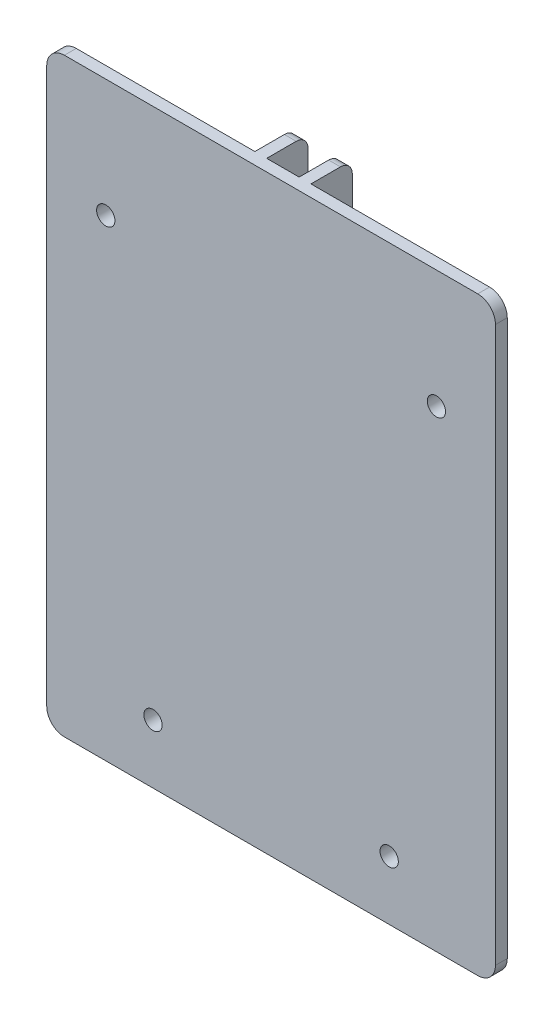
ISO-10303-21;
HEADER;
FILE_DESCRIPTION(('STEP AP214'),'2;1');
FILE_NAME('part.step','',(''),(''),'','','');
FILE_SCHEMA(('AUTOMOTIVE_DESIGN { 1 0 10303 214 1 1 1 1 }'));
ENDSEC;
DATA;
#1=APPLICATION_CONTEXT('core data for automotive mechanical design processes');
#2=APPLICATION_PROTOCOL_DEFINITION('international standard','automotive_design',2000,#1);
#3=PRODUCT_CONTEXT('',#1,'mechanical');
#4=PRODUCT('Part','Part','',(#3));
#5=PRODUCT_RELATED_PRODUCT_CATEGORY('part','',(#4));
#6=PRODUCT_DEFINITION_FORMATION('','',#4);
#7=PRODUCT_DEFINITION_CONTEXT('part definition',#1,'design');
#8=PRODUCT_DEFINITION('design','',#6,#7);
#9=PRODUCT_DEFINITION_SHAPE('','',#8);
#10=(LENGTH_UNIT() NAMED_UNIT(*) SI_UNIT(.MILLI.,.METRE.));
#11=(NAMED_UNIT(*) PLANE_ANGLE_UNIT() SI_UNIT($,.RADIAN.));
#12=(NAMED_UNIT(*) SI_UNIT($,.STERADIAN.) SOLID_ANGLE_UNIT());
#13=UNCERTAINTY_MEASURE_WITH_UNIT(LENGTH_MEASURE(1.E-05),#10,'distance_accuracy_value','');
#14=(GEOMETRIC_REPRESENTATION_CONTEXT(3) GLOBAL_UNCERTAINTY_ASSIGNED_CONTEXT((#13)) GLOBAL_UNIT_ASSIGNED_CONTEXT((#10,
#11,#12)) REPRESENTATION_CONTEXT('',''));
#15=CARTESIAN_POINT('',(0.,0.,0.));
#16=DIRECTION('',(0.,0.,1.));
#17=DIRECTION('',(1.,0.,0.));
#18=AXIS2_PLACEMENT_3D('',#15,#16,#17);
#19=CARTESIAN_POINT('',(0.,0.,9.));
#20=DIRECTION('',(1.,0.,0.));
#21=DIRECTION('',(0.,0.,-1.));
#22=AXIS2_PLACEMENT_3D('',#19,#20,#21);
#23=PLANE('',#22);
#24=DIRECTION('',(0.,1.,0.));
#25=VECTOR('',#24,1.);
#26=CARTESIAN_POINT('',(0.,100.,7.));
#27=LINE('',#26,#25);
#28=CARTESIAN_POINT('',(0.,3.,7.));
#29=VERTEX_POINT('',#28);
#30=CARTESIAN_POINT('',(0.,97.,7.));
#31=VERTEX_POINT('',#30);
#32=EDGE_CURVE('E203',#29,#31,#27,.T.);
#33=ORIENTED_EDGE('',*,*,#32,.F.);
#34=DIRECTION('',(0.,0.,-1.));
#35=VECTOR('',#34,1.);
#36=CARTESIAN_POINT('',(0.,3.,9.));
#37=LINE('',#36,#35);
#38=CARTESIAN_POINT('',(0.,3.,9.));
#39=VERTEX_POINT('',#38);
#40=EDGE_CURVE('E294',#29,#39,#37,.F.);
#41=ORIENTED_EDGE('',*,*,#40,.T.);
#42=DIRECTION('',(0.,-1.,0.));
#43=VECTOR('',#42,1.);
#44=CARTESIAN_POINT('',(0.,0.,9.));
#45=LINE('',#44,#43);
#46=CARTESIAN_POINT('',(0.,97.,9.));
#47=VERTEX_POINT('',#46);
#48=EDGE_CURVE('E212',#47,#39,#45,.T.);
#49=ORIENTED_EDGE('',*,*,#48,.F.);
#50=DIRECTION('',(0.,0.,-1.));
#51=VECTOR('',#50,1.);
#52=CARTESIAN_POINT('',(0.,97.,9.));
#53=LINE('',#52,#51);
#54=EDGE_CURVE('E291',#47,#31,#53,.T.);
#55=ORIENTED_EDGE('',*,*,#54,.T.);
#56=EDGE_LOOP('',(#33,#41,#49,#55));
#57=FACE_BOUND('',#56,.T.);
#58=ADVANCED_FACE('F33',(#57),#23,.F.);
#59=CARTESIAN_POINT('',(76.,0.,9.));
#60=DIRECTION('',(-1.,0.,0.));
#61=DIRECTION('',(0.,0.,1.));
#62=AXIS2_PLACEMENT_3D('',#59,#60,#61);
#63=PLANE('',#62);
#64=DIRECTION('',(0.,1.,0.));
#65=VECTOR('',#64,1.);
#66=CARTESIAN_POINT('',(76.,0.,9.));
#67=LINE('',#66,#65);
#68=CARTESIAN_POINT('',(76.,3.,9.));
#69=VERTEX_POINT('',#68);
#70=CARTESIAN_POINT('',(76.,97.,9.));
#71=VERTEX_POINT('',#70);
#72=EDGE_CURVE('E268',#69,#71,#67,.T.);
#73=ORIENTED_EDGE('',*,*,#72,.F.);
#74=DIRECTION('',(0.,0.,-1.));
#75=VECTOR('',#74,1.);
#76=CARTESIAN_POINT('',(76.,3.,9.));
#77=LINE('',#76,#75);
#78=CARTESIAN_POINT('',(76.,3.,7.));
#79=VERTEX_POINT('',#78);
#80=EDGE_CURVE('E306',#69,#79,#77,.T.);
#81=ORIENTED_EDGE('',*,*,#80,.T.);
#82=DIRECTION('',(0.,-1.,0.));
#83=VECTOR('',#82,1.);
#84=CARTESIAN_POINT('',(76.,100.,7.));
#85=LINE('',#84,#83);
#86=CARTESIAN_POINT('',(76.,97.,7.));
#87=VERTEX_POINT('',#86);
#88=EDGE_CURVE('E214',#87,#79,#85,.T.);
#89=ORIENTED_EDGE('',*,*,#88,.F.);
#90=DIRECTION('',(0.,0.,-1.));
#91=VECTOR('',#90,1.);
#92=CARTESIAN_POINT('',(76.,97.,9.));
#93=LINE('',#92,#91);
#94=EDGE_CURVE('E304',#87,#71,#93,.F.);
#95=ORIENTED_EDGE('',*,*,#94,.T.);
#96=EDGE_LOOP('',(#73,#81,#89,#95));
#97=FACE_BOUND('',#96,.T.);
#98=ADVANCED_FACE('F422',(#97),#63,.F.);
#99=CARTESIAN_POINT('',(0.,0.,0.));
#100=DIRECTION('',(0.,0.,-1.));
#101=DIRECTION('',(-1.,0.,0.));
#102=AXIS2_PLACEMENT_3D('',#99,#100,#101);
#103=PLANE('',#102);
#104=DIRECTION('',(0.,1.,0.));
#105=VECTOR('',#104,1.);
#106=CARTESIAN_POINT('',(35.25,100.,0.));
#107=LINE('',#106,#105);
#108=CARTESIAN_POINT('',(35.25,2.,0.));
#109=VERTEX_POINT('',#108);
#110=CARTESIAN_POINT('',(35.25,98.,0.));
#111=VERTEX_POINT('',#110);
#112=EDGE_CURVE('E248',#109,#111,#107,.T.);
#113=ORIENTED_EDGE('',*,*,#112,.F.);
#114=DIRECTION('',(1.,0.,0.));
#115=VECTOR('',#114,1.);
#116=CARTESIAN_POINT('',(33.25,2.,0.));
#117=LINE('',#116,#115);
#118=CARTESIAN_POINT('',(33.25,2.,0.));
#119=VERTEX_POINT('',#118);
#120=EDGE_CURVE('E329',#109,#119,#117,.F.);
#121=ORIENTED_EDGE('',*,*,#120,.T.);
#122=DIRECTION('',(0.,-1.,0.));
#123=VECTOR('',#122,1.);
#124=CARTESIAN_POINT('',(33.25,100.,0.));
#125=LINE('',#124,#123);
#126=CARTESIAN_POINT('',(33.25,98.,0.));
#127=VERTEX_POINT('',#126);
#128=EDGE_CURVE('E196',#127,#119,#125,.T.);
#129=ORIENTED_EDGE('',*,*,#128,.F.);
#130=DIRECTION('',(-1.,0.,0.));
#131=VECTOR('',#130,1.);
#132=CARTESIAN_POINT('',(35.25,98.,0.));
#133=LINE('',#132,#131);
#134=EDGE_CURVE('E327',#127,#111,#133,.F.);
#135=ORIENTED_EDGE('',*,*,#134,.T.);
#136=EDGE_LOOP('',(#113,#121,#129,#135));
#137=FACE_BOUND('',#136,.T.);
#138=ADVANCED_FACE('F428',(#137),#103,.T.);
#139=CARTESIAN_POINT('',(0.,0.,9.));
#140=DIRECTION('',(0.,1.,0.));
#141=DIRECTION('',(0.,0.,1.));
#142=AXIS2_PLACEMENT_3D('',#139,#140,#141);
#143=PLANE('',#142);
#144=DIRECTION('',(0.,0.,-1.));
#145=VECTOR('',#144,1.);
#146=CARTESIAN_POINT('',(33.25,0.,7.));
#147=LINE('',#146,#145);
#148=CARTESIAN_POINT('',(33.25,0.,7.));
#149=VERTEX_POINT('',#148);
#150=CARTESIAN_POINT('',(33.25,0.,2.));
#151=VERTEX_POINT('',#150);
#152=EDGE_CURVE('E175',#149,#151,#147,.T.);
#153=ORIENTED_EDGE('',*,*,#152,.T.);
#154=DIRECTION('',(1.,0.,0.));
#155=VECTOR('',#154,1.);
#156=CARTESIAN_POINT('',(35.25,0.,2.));
#157=LINE('',#156,#155);
#158=CARTESIAN_POINT('',(35.25,0.,2.));
#159=VERTEX_POINT('',#158);
#160=EDGE_CURVE('E321',#151,#159,#157,.T.);
#161=ORIENTED_EDGE('',*,*,#160,.T.);
#162=DIRECTION('',(0.,0.,-1.));
#163=VECTOR('',#162,1.);
#164=CARTESIAN_POINT('',(35.25,0.,7.));
#165=LINE('',#164,#163);
#166=CARTESIAN_POINT('',(35.25,0.,7.));
#167=VERTEX_POINT('',#166);
#168=EDGE_CURVE('E229',#167,#159,#165,.T.);
#169=ORIENTED_EDGE('',*,*,#168,.F.);
#170=DIRECTION('',(-1.,0.,0.));
#171=VECTOR('',#170,1.);
#172=CARTESIAN_POINT('',(35.25,0.,7.));
#173=LINE('',#172,#171);
#174=CARTESIAN_POINT('',(40.75,0.,7.));
#175=VERTEX_POINT('',#174);
#176=EDGE_CURVE('E244',#175,#167,#173,.T.);
#177=ORIENTED_EDGE('',*,*,#176,.F.);
#178=DIRECTION('',(0.,0.,-1.));
#179=VECTOR('',#178,1.);
#180=CARTESIAN_POINT('',(40.75,0.,7.));
#181=LINE('',#180,#179);
#182=CARTESIAN_POINT('',(40.75,0.,2.));
#183=VERTEX_POINT('',#182);
#184=EDGE_CURVE('E255',#175,#183,#181,.T.);
#185=ORIENTED_EDGE('',*,*,#184,.T.);
#186=DIRECTION('',(1.,0.,0.));
#187=VECTOR('',#186,1.);
#188=CARTESIAN_POINT('',(42.75,0.,2.));
#189=LINE('',#188,#187);
#190=CARTESIAN_POINT('',(42.75,0.,2.));
#191=VERTEX_POINT('',#190);
#192=EDGE_CURVE('E318',#183,#191,#189,.T.);
#193=ORIENTED_EDGE('',*,*,#192,.T.);
#194=DIRECTION('',(0.,0.,-1.));
#195=VECTOR('',#194,1.);
#196=CARTESIAN_POINT('',(42.75,0.,7.));
#197=LINE('',#196,#195);
#198=CARTESIAN_POINT('',(42.75,0.,7.));
#199=VERTEX_POINT('',#198);
#200=EDGE_CURVE('E226',#199,#191,#197,.T.);
#201=ORIENTED_EDGE('',*,*,#200,.F.);
#202=DIRECTION('',(-1.,0.,0.));
#203=VECTOR('',#202,1.);
#204=CARTESIAN_POINT('',(76.,0.,7.));
#205=LINE('',#204,#203);
#206=CARTESIAN_POINT('',(73.,0.,7.));
#207=VERTEX_POINT('',#206);
#208=EDGE_CURVE('E217',#207,#199,#205,.T.);
#209=ORIENTED_EDGE('',*,*,#208,.F.);
#210=DIRECTION('',(0.,0.,-1.));
#211=VECTOR('',#210,1.);
#212=CARTESIAN_POINT('',(73.,0.,9.));
#213=LINE('',#212,#211);
#214=CARTESIAN_POINT('',(73.,0.,9.));
#215=VERTEX_POINT('',#214);
#216=EDGE_CURVE('E274',#207,#215,#213,.F.);
#217=ORIENTED_EDGE('',*,*,#216,.T.);
#218=DIRECTION('',(1.,0.,0.));
#219=VECTOR('',#218,1.);
#220=CARTESIAN_POINT('',(0.,0.,9.));
#221=LINE('',#220,#219);
#222=CARTESIAN_POINT('',(3.,0.,9.));
#223=VERTEX_POINT('',#222);
#224=EDGE_CURVE('E265',#223,#215,#221,.T.);
#225=ORIENTED_EDGE('',*,*,#224,.F.);
#226=DIRECTION('',(0.,0.,-1.));
#227=VECTOR('',#226,1.);
#228=CARTESIAN_POINT('',(3.,0.,9.));
#229=LINE('',#228,#227);
#230=CARTESIAN_POINT('',(3.,0.,7.));
#231=VERTEX_POINT('',#230);
#232=EDGE_CURVE('E202',#223,#231,#229,.T.);
#233=ORIENTED_EDGE('',*,*,#232,.T.);
#234=DIRECTION('',(-1.,0.,0.));
#235=VECTOR('',#234,1.);
#236=CARTESIAN_POINT('',(33.25,0.,7.));
#237=LINE('',#236,#235);
#238=EDGE_CURVE('E194',#149,#231,#237,.T.);
#239=ORIENTED_EDGE('',*,*,#238,.F.);
#240=EDGE_LOOP('',(#153,#161,#169,#177,#185,#193,#201,#209,#217,#225,#233,#239));
#241=FACE_BOUND('',#240,.T.);
#242=ADVANCED_FACE('F199',(#241),#143,.F.);
#243=CARTESIAN_POINT('',(0.,100.,9.));
#244=DIRECTION('',(0.,-1.,0.));
#245=DIRECTION('',(0.,0.,-1.));
#246=AXIS2_PLACEMENT_3D('',#243,#244,#245);
#247=PLANE('',#246);
#248=DIRECTION('',(0.,0.,-1.));
#249=VECTOR('',#248,1.);
#250=CARTESIAN_POINT('',(35.25,100.,7.));
#251=LINE('',#250,#249);
#252=CARTESIAN_POINT('',(35.25,100.,7.));
#253=VERTEX_POINT('',#252);
#254=CARTESIAN_POINT('',(35.25,100.,2.));
#255=VERTEX_POINT('',#254);
#256=EDGE_CURVE('E247',#253,#255,#251,.T.);
#257=ORIENTED_EDGE('',*,*,#256,.T.);
#258=DIRECTION('',(-1.,0.,0.));
#259=VECTOR('',#258,1.);
#260=CARTESIAN_POINT('',(33.25,100.,2.));
#261=LINE('',#260,#259);
#262=CARTESIAN_POINT('',(33.25,100.,2.));
#263=VERTEX_POINT('',#262);
#264=EDGE_CURVE('E11',#255,#263,#261,.T.);
#265=ORIENTED_EDGE('',*,*,#264,.T.);
#266=DIRECTION('',(0.,0.,-1.));
#267=VECTOR('',#266,1.);
#268=CARTESIAN_POINT('',(33.25,100.,7.));
#269=LINE('',#268,#267);
#270=CARTESIAN_POINT('',(33.25,100.,7.));
#271=VERTEX_POINT('',#270);
#272=EDGE_CURVE('E188',#271,#263,#269,.T.);
#273=ORIENTED_EDGE('',*,*,#272,.F.);
#274=DIRECTION('',(1.,0.,0.));
#275=VECTOR('',#274,1.);
#276=CARTESIAN_POINT('',(33.25,100.,7.));
#277=LINE('',#276,#275);
#278=CARTESIAN_POINT('',(3.,100.,7.));
#279=VERTEX_POINT('',#278);
#280=EDGE_CURVE('E189',#279,#271,#277,.T.);
#281=ORIENTED_EDGE('',*,*,#280,.F.);
#282=DIRECTION('',(0.,0.,-1.));
#283=VECTOR('',#282,1.);
#284=CARTESIAN_POINT('',(3.,100.,9.));
#285=LINE('',#284,#283);
#286=CARTESIAN_POINT('',(3.,100.,9.));
#287=VERTEX_POINT('',#286);
#288=EDGE_CURVE('E316',#279,#287,#285,.F.);
#289=ORIENTED_EDGE('',*,*,#288,.T.);
#290=DIRECTION('',(-1.,0.,0.));
#291=VECTOR('',#290,1.);
#292=CARTESIAN_POINT('',(0.,100.,9.));
#293=LINE('',#292,#291);
#294=CARTESIAN_POINT('',(73.,100.,9.));
#295=VERTEX_POINT('',#294);
#296=EDGE_CURVE('E271',#295,#287,#293,.T.);
#297=ORIENTED_EDGE('',*,*,#296,.F.);
#298=DIRECTION('',(0.,0.,-1.));
#299=VECTOR('',#298,1.);
#300=CARTESIAN_POINT('',(73.,100.,9.));
#301=LINE('',#300,#299);
#302=CARTESIAN_POINT('',(73.,100.,7.));
#303=VERTEX_POINT('',#302);
#304=EDGE_CURVE('E313',#295,#303,#301,.T.);
#305=ORIENTED_EDGE('',*,*,#304,.T.);
#306=DIRECTION('',(1.,0.,0.));
#307=VECTOR('',#306,1.);
#308=CARTESIAN_POINT('',(76.,100.,7.));
#309=LINE('',#308,#307);
#310=CARTESIAN_POINT('',(42.75,100.,7.));
#311=VERTEX_POINT('',#310);
#312=EDGE_CURVE('E223',#311,#303,#309,.T.);
#313=ORIENTED_EDGE('',*,*,#312,.F.);
#314=DIRECTION('',(0.,0.,-1.));
#315=VECTOR('',#314,1.);
#316=CARTESIAN_POINT('',(42.75,100.,7.));
#317=LINE('',#316,#315);
#318=CARTESIAN_POINT('',(42.75,100.,2.));
#319=VERTEX_POINT('',#318);
#320=EDGE_CURVE('E211',#311,#319,#317,.T.);
#321=ORIENTED_EDGE('',*,*,#320,.T.);
#322=DIRECTION('',(-1.,0.,0.));
#323=VECTOR('',#322,1.);
#324=CARTESIAN_POINT('',(40.75,100.,2.));
#325=LINE('',#324,#323);
#326=CARTESIAN_POINT('',(40.75,100.,2.));
#327=VERTEX_POINT('',#326);
#328=EDGE_CURVE('E42',#319,#327,#325,.T.);
#329=ORIENTED_EDGE('',*,*,#328,.T.);
#330=DIRECTION('',(0.,0.,-1.));
#331=VECTOR('',#330,1.);
#332=CARTESIAN_POINT('',(40.75,100.,7.));
#333=LINE('',#332,#331);
#334=CARTESIAN_POINT('',(40.75,100.,7.));
#335=VERTEX_POINT('',#334);
#336=EDGE_CURVE('E258',#335,#327,#333,.T.);
#337=ORIENTED_EDGE('',*,*,#336,.F.);
#338=DIRECTION('',(1.,0.,0.));
#339=VECTOR('',#338,1.);
#340=CARTESIAN_POINT('',(35.25,100.,7.));
#341=LINE('',#340,#339);
#342=EDGE_CURVE('E237',#253,#335,#341,.T.);
#343=ORIENTED_EDGE('',*,*,#342,.F.);
#344=EDGE_LOOP('',(#257,#265,#273,#281,#289,#297,#305,#313,#321,#329,#337,#343));
#345=FACE_BOUND('',#344,.T.);
#346=ADVANCED_FACE('F470',(#345),#247,.F.);
#347=CARTESIAN_POINT('',(0.,0.,9.));
#348=DIRECTION('',(0.,0.,-1.));
#349=DIRECTION('',(-1.,0.,0.));
#350=AXIS2_PLACEMENT_3D('',#347,#348,#349);
#351=PLANE('',#350);
#352=CARTESIAN_POINT('',(66.,80.,9.));
#353=DIRECTION('',(0.,0.,-1.));
#354=DIRECTION('',(-1.,0.,0.));
#355=AXIS2_PLACEMENT_3D('',#352,#353,#354);
#356=CIRCLE('',#355,1.54999999999999);
#357=CARTESIAN_POINT('',(64.45,80.,9.));
#358=VERTEX_POINT('',#357);
#359=EDGE_CURVE('E349',#358,#358,#356,.T.);
#360=ORIENTED_EDGE('',*,*,#359,.T.);
#361=EDGE_LOOP('',(#360));
#362=FACE_BOUND('',#361,.T.);
#363=CARTESIAN_POINT('',(58.,10.,9.));
#364=DIRECTION('',(0.,0.,-1.));
#365=DIRECTION('',(-1.,0.,0.));
#366=AXIS2_PLACEMENT_3D('',#363,#364,#365);
#367=CIRCLE('',#366,1.55);
#368=CARTESIAN_POINT('',(56.45,10.,9.));
#369=VERTEX_POINT('',#368);
#370=EDGE_CURVE('E743',#369,#369,#367,.T.);
#371=ORIENTED_EDGE('',*,*,#370,.T.);
#372=EDGE_LOOP('',(#371));
#373=FACE_BOUND('',#372,.T.);
#374=CARTESIAN_POINT('',(18.,10.,9.));
#375=DIRECTION('',(0.,0.,-1.));
#376=DIRECTION('',(-1.,0.,0.));
#377=AXIS2_PLACEMENT_3D('',#374,#375,#376);
#378=CIRCLE('',#377,1.55);
#379=CARTESIAN_POINT('',(16.45,10.,9.));
#380=VERTEX_POINT('',#379);
#381=EDGE_CURVE('E746',#380,#380,#378,.T.);
#382=ORIENTED_EDGE('',*,*,#381,.T.);
#383=EDGE_LOOP('',(#382));
#384=FACE_BOUND('',#383,.T.);
#385=CARTESIAN_POINT('',(10.,80.,9.));
#386=DIRECTION('',(0.,0.,-1.));
#387=DIRECTION('',(-1.,0.,0.));
#388=AXIS2_PLACEMENT_3D('',#385,#386,#387);
#389=CIRCLE('',#388,1.54999999999999);
#390=CARTESIAN_POINT('',(8.45000000000001,80.,9.));
#391=VERTEX_POINT('',#390);
#392=EDGE_CURVE('E750',#391,#391,#389,.T.);
#393=ORIENTED_EDGE('',*,*,#392,.T.);
#394=EDGE_LOOP('',(#393));
#395=FACE_BOUND('',#394,.T.);
#396=ORIENTED_EDGE('',*,*,#48,.T.);
#397=CARTESIAN_POINT('',(3.,3.,9.));
#398=DIRECTION('',(0.,0.,-1.));
#399=DIRECTION('',(-1.,0.,0.));
#400=AXIS2_PLACEMENT_3D('',#397,#398,#399);
#401=CIRCLE('',#400,3.);
#402=EDGE_CURVE('E302',#39,#223,#401,.F.);
#403=ORIENTED_EDGE('',*,*,#402,.T.);
#404=ORIENTED_EDGE('',*,*,#224,.T.);
#405=CARTESIAN_POINT('',(73.,3.,9.));
#406=DIRECTION('',(0.,0.,-1.));
#407=DIRECTION('',(-1.,0.,0.));
#408=AXIS2_PLACEMENT_3D('',#405,#406,#407);
#409=CIRCLE('',#408,3.);
#410=EDGE_CURVE('E300',#215,#69,#409,.F.);
#411=ORIENTED_EDGE('',*,*,#410,.T.);
#412=ORIENTED_EDGE('',*,*,#72,.T.);
#413=CARTESIAN_POINT('',(73.,97.,9.));
#414=DIRECTION('',(0.,0.,-1.));
#415=DIRECTION('',(-1.,0.,0.));
#416=AXIS2_PLACEMENT_3D('',#413,#414,#415);
#417=CIRCLE('',#416,3.);
#418=EDGE_CURVE('E296',#71,#295,#417,.F.);
#419=ORIENTED_EDGE('',*,*,#418,.T.);
#420=ORIENTED_EDGE('',*,*,#296,.T.);
#421=CARTESIAN_POINT('',(3.,97.,9.));
#422=DIRECTION('',(0.,0.,-1.));
#423=DIRECTION('',(-1.,0.,0.));
#424=AXIS2_PLACEMENT_3D('',#421,#422,#423);
#425=CIRCLE('',#424,3.);
#426=EDGE_CURVE('E298',#287,#47,#425,.F.);
#427=ORIENTED_EDGE('',*,*,#426,.T.);
#428=EDGE_LOOP('',(#396,#403,#404,#411,#412,#419,#420,#427));
#429=FACE_BOUND('',#428,.T.);
#430=ADVANCED_FACE('F485',(#362,#373,#384,#395,#429),#351,.F.);
#431=DIRECTION('',(0.,1.,0.));
#432=VECTOR('',#431,1.);
#433=CARTESIAN_POINT('',(42.75,100.,0.));
#434=LINE('',#433,#432);
#435=CARTESIAN_POINT('',(42.75,2.,0.));
#436=VERTEX_POINT('',#435);
#437=CARTESIAN_POINT('',(42.75,98.,0.));
#438=VERTEX_POINT('',#437);
#439=EDGE_CURVE('E218',#436,#438,#434,.T.);
#440=ORIENTED_EDGE('',*,*,#439,.F.);
#441=DIRECTION('',(1.,0.,0.));
#442=VECTOR('',#441,1.);
#443=CARTESIAN_POINT('',(40.75,2.,0.));
#444=LINE('',#443,#442);
#445=CARTESIAN_POINT('',(40.75,2.,0.));
#446=VERTEX_POINT('',#445);
#447=EDGE_CURVE('E58',#436,#446,#444,.F.);
#448=ORIENTED_EDGE('',*,*,#447,.T.);
#449=DIRECTION('',(0.,-1.,0.));
#450=VECTOR('',#449,1.);
#451=CARTESIAN_POINT('',(40.75,100.,0.));
#452=LINE('',#451,#450);
#453=CARTESIAN_POINT('',(40.75,98.,0.));
#454=VERTEX_POINT('',#453);
#455=EDGE_CURVE('E238',#454,#446,#452,.T.);
#456=ORIENTED_EDGE('',*,*,#455,.F.);
#457=DIRECTION('',(-1.,0.,0.));
#458=VECTOR('',#457,1.);
#459=CARTESIAN_POINT('',(42.75,98.,0.));
#460=LINE('',#459,#458);
#461=EDGE_CURVE('E338',#454,#438,#460,.F.);
#462=ORIENTED_EDGE('',*,*,#461,.T.);
#463=EDGE_LOOP('',(#440,#448,#456,#462));
#464=FACE_BOUND('',#463,.T.);
#465=ADVANCED_FACE('F507',(#464),#103,.T.);
#466=CARTESIAN_POINT('',(35.25,100.,7.));
#467=DIRECTION('',(-1.,0.,0.));
#468=DIRECTION('',(0.,-1.,0.));
#469=AXIS2_PLACEMENT_3D('',#466,#467,#468);
#470=PLANE('',#469);
#471=CARTESIAN_POINT('',(35.25,20.,3.5));
#472=DIRECTION('',(-1.,0.,0.));
#473=DIRECTION('',(0.,-1.,0.));
#474=AXIS2_PLACEMENT_3D('',#471,#472,#473);
#475=CIRCLE('',#474,1.55);
#476=CARTESIAN_POINT('',(35.25,18.45,3.5));
#477=VERTEX_POINT('',#476);
#478=EDGE_CURVE('E251',#477,#477,#475,.T.);
#479=ORIENTED_EDGE('',*,*,#478,.T.);
#480=EDGE_LOOP('',(#479));
#481=FACE_BOUND('',#480,.T.);
#482=CARTESIAN_POINT('',(35.25,90.,3.5));
#483=DIRECTION('',(-1.,0.,0.));
#484=DIRECTION('',(0.,-1.,0.));
#485=AXIS2_PLACEMENT_3D('',#482,#483,#484);
#486=CIRCLE('',#485,1.55);
#487=CARTESIAN_POINT('',(35.25,88.45,3.5));
#488=VERTEX_POINT('',#487);
#489=EDGE_CURVE('E284',#488,#488,#486,.T.);
#490=ORIENTED_EDGE('',*,*,#489,.T.);
#491=EDGE_LOOP('',(#490));
#492=FACE_BOUND('',#491,.T.);
#493=ORIENTED_EDGE('',*,*,#168,.T.);
#494=CARTESIAN_POINT('',(35.25,2.,2.));
#495=DIRECTION('',(-1.,0.,0.));
#496=DIRECTION('',(0.,-1.,0.));
#497=AXIS2_PLACEMENT_3D('',#494,#495,#496);
#498=CIRCLE('',#497,2.);
#499=EDGE_CURVE('E325',#159,#109,#498,.F.);
#500=ORIENTED_EDGE('',*,*,#499,.T.);
#501=ORIENTED_EDGE('',*,*,#112,.T.);
#502=CARTESIAN_POINT('',(35.25,98.,2.));
#503=DIRECTION('',(-1.,0.,0.));
#504=DIRECTION('',(0.,-1.,0.));
#505=AXIS2_PLACEMENT_3D('',#502,#503,#504);
#506=CIRCLE('',#505,2.);
#507=EDGE_CURVE('E323',#111,#255,#506,.F.);
#508=ORIENTED_EDGE('',*,*,#507,.T.);
#509=ORIENTED_EDGE('',*,*,#256,.F.);
#510=DIRECTION('',(0.,1.,0.));
#511=VECTOR('',#510,1.);
#512=CARTESIAN_POINT('',(35.25,100.,7.));
#513=LINE('',#512,#511);
#514=EDGE_CURVE('E234',#167,#253,#513,.T.);
#515=ORIENTED_EDGE('',*,*,#514,.F.);
#516=EDGE_LOOP('',(#493,#500,#501,#508,#509,#515));
#517=FACE_BOUND('',#516,.T.);
#518=ADVANCED_FACE('F399',(#481,#492,#517),#470,.F.);
#519=CARTESIAN_POINT('',(40.75,100.,7.));
#520=DIRECTION('',(1.,0.,0.));
#521=DIRECTION('',(0.,1.,0.));
#522=AXIS2_PLACEMENT_3D('',#519,#520,#521);
#523=PLANE('',#522);
#524=CARTESIAN_POINT('',(40.75,20.,3.5));
#525=DIRECTION('',(1.,0.,0.));
#526=DIRECTION('',(0.,1.,0.));
#527=AXIS2_PLACEMENT_3D('',#524,#525,#526);
#528=CIRCLE('',#527,1.55);
#529=CARTESIAN_POINT('',(40.75,21.55,3.5));
#530=VERTEX_POINT('',#529);
#531=EDGE_CURVE('E283',#530,#530,#528,.T.);
#532=ORIENTED_EDGE('',*,*,#531,.T.);
#533=EDGE_LOOP('',(#532));
#534=FACE_BOUND('',#533,.T.);
#535=CARTESIAN_POINT('',(40.75,90.,3.5));
#536=DIRECTION('',(1.,0.,0.));
#537=DIRECTION('',(0.,1.,0.));
#538=AXIS2_PLACEMENT_3D('',#535,#536,#537);
#539=CIRCLE('',#538,1.55);
#540=CARTESIAN_POINT('',(40.75,91.55,3.5));
#541=VERTEX_POINT('',#540);
#542=EDGE_CURVE('E278',#541,#541,#539,.T.);
#543=ORIENTED_EDGE('',*,*,#542,.T.);
#544=EDGE_LOOP('',(#543));
#545=FACE_BOUND('',#544,.T.);
#546=ORIENTED_EDGE('',*,*,#455,.T.);
#547=CARTESIAN_POINT('',(40.75,2.,2.));
#548=DIRECTION('',(1.,0.,0.));
#549=DIRECTION('',(0.,1.,0.));
#550=AXIS2_PLACEMENT_3D('',#547,#548,#549);
#551=CIRCLE('',#550,2.);
#552=EDGE_CURVE('E342',#446,#183,#551,.F.);
#553=ORIENTED_EDGE('',*,*,#552,.T.);
#554=ORIENTED_EDGE('',*,*,#184,.F.);
#555=DIRECTION('',(0.,-1.,0.));
#556=VECTOR('',#555,1.);
#557=CARTESIAN_POINT('',(40.75,100.,7.));
#558=LINE('',#557,#556);
#559=EDGE_CURVE('E241',#335,#175,#558,.T.);
#560=ORIENTED_EDGE('',*,*,#559,.F.);
#561=ORIENTED_EDGE('',*,*,#336,.T.);
#562=CARTESIAN_POINT('',(40.75,98.,2.));
#563=DIRECTION('',(1.,0.,0.));
#564=DIRECTION('',(0.,1.,0.));
#565=AXIS2_PLACEMENT_3D('',#562,#563,#564);
#566=CIRCLE('',#565,2.);
#567=EDGE_CURVE('E50',#327,#454,#566,.F.);
#568=ORIENTED_EDGE('',*,*,#567,.T.);
#569=EDGE_LOOP('',(#546,#553,#554,#560,#561,#568));
#570=FACE_BOUND('',#569,.T.);
#571=ADVANCED_FACE('F509',(#534,#545,#570),#523,.F.);
#572=CARTESIAN_POINT('',(0.,0.,7.));
#573=DIRECTION('',(0.,0.,1.));
#574=DIRECTION('',(1.,0.,0.));
#575=AXIS2_PLACEMENT_3D('',#572,#573,#574);
#576=PLANE('',#575);
#577=ORIENTED_EDGE('',*,*,#514,.T.);
#578=ORIENTED_EDGE('',*,*,#342,.T.);
#579=ORIENTED_EDGE('',*,*,#559,.T.);
#580=ORIENTED_EDGE('',*,*,#176,.T.);
#581=EDGE_LOOP('',(#577,#578,#579,#580));
#582=FACE_BOUND('',#581,.T.);
#583=ADVANCED_FACE('F473',(#582),#576,.F.);
#584=CARTESIAN_POINT('',(42.75,100.,7.));
#585=DIRECTION('',(-1.,0.,0.));
#586=DIRECTION('',(0.,-1.,0.));
#587=AXIS2_PLACEMENT_3D('',#584,#585,#586);
#588=PLANE('',#587);
#589=CARTESIAN_POINT('',(42.75,20.,3.5));
#590=DIRECTION('',(1.,0.,0.));
#591=DIRECTION('',(0.,1.,0.));
#592=AXIS2_PLACEMENT_3D('',#589,#590,#591);
#593=CIRCLE('',#592,1.55);
#594=CARTESIAN_POINT('',(42.75,21.55,3.5));
#595=VERTEX_POINT('',#594);
#596=EDGE_CURVE('E279',#595,#595,#593,.T.);
#597=ORIENTED_EDGE('',*,*,#596,.F.);
#598=EDGE_LOOP('',(#597));
#599=FACE_BOUND('',#598,.T.);
#600=CARTESIAN_POINT('',(42.75,90.,3.5));
#601=DIRECTION('',(1.,0.,0.));
#602=DIRECTION('',(0.,1.,0.));
#603=AXIS2_PLACEMENT_3D('',#600,#601,#602);
#604=CIRCLE('',#603,1.55);
#605=CARTESIAN_POINT('',(42.75,91.55,3.5));
#606=VERTEX_POINT('',#605);
#607=EDGE_CURVE('E384',#606,#606,#604,.T.);
#608=ORIENTED_EDGE('',*,*,#607,.F.);
#609=EDGE_LOOP('',(#608));
#610=FACE_BOUND('',#609,.T.);
#611=ORIENTED_EDGE('',*,*,#200,.T.);
#612=CARTESIAN_POINT('',(42.75,2.,2.));
#613=DIRECTION('',(-1.,0.,0.));
#614=DIRECTION('',(0.,-1.,0.));
#615=AXIS2_PLACEMENT_3D('',#612,#613,#614);
#616=CIRCLE('',#615,2.);
#617=EDGE_CURVE('E336',#191,#436,#616,.F.);
#618=ORIENTED_EDGE('',*,*,#617,.T.);
#619=ORIENTED_EDGE('',*,*,#439,.T.);
#620=CARTESIAN_POINT('',(42.75,98.,2.));
#621=DIRECTION('',(-1.,0.,0.));
#622=DIRECTION('',(0.,-1.,0.));
#623=AXIS2_PLACEMENT_3D('',#620,#621,#622);
#624=CIRCLE('',#623,2.);
#625=EDGE_CURVE('E334',#438,#319,#624,.F.);
#626=ORIENTED_EDGE('',*,*,#625,.T.);
#627=ORIENTED_EDGE('',*,*,#320,.F.);
#628=DIRECTION('',(0.,1.,0.));
#629=VECTOR('',#628,1.);
#630=CARTESIAN_POINT('',(42.75,100.,7.));
#631=LINE('',#630,#629);
#632=EDGE_CURVE('E220',#199,#311,#631,.T.);
#633=ORIENTED_EDGE('',*,*,#632,.F.);
#634=EDGE_LOOP('',(#611,#618,#619,#626,#627,#633));
#635=FACE_BOUND('',#634,.T.);
#636=ADVANCED_FACE('F503',(#599,#610,#635),#588,.F.);
#637=CARTESIAN_POINT('',(0.,0.,7.));
#638=DIRECTION('',(0.,0.,-1.));
#639=DIRECTION('',(-1.,0.,0.));
#640=AXIS2_PLACEMENT_3D('',#637,#638,#639);
#641=PLANE('',#640);
#642=CARTESIAN_POINT('',(58.,10.,7.));
#643=DIRECTION('',(0.,0.,-1.));
#644=DIRECTION('',(-1.,0.,0.));
#645=AXIS2_PLACEMENT_3D('',#642,#643,#644);
#646=CIRCLE('',#645,3.);
#647=CARTESIAN_POINT('',(55.,10.,7.));
#648=VERTEX_POINT('',#647);
#649=EDGE_CURVE('E356',#648,#648,#646,.T.);
#650=ORIENTED_EDGE('',*,*,#649,.F.);
#651=EDGE_LOOP('',(#650));
#652=FACE_BOUND('',#651,.T.);
#653=CARTESIAN_POINT('',(66.,80.,7.));
#654=DIRECTION('',(0.,0.,-1.));
#655=DIRECTION('',(-1.,0.,0.));
#656=AXIS2_PLACEMENT_3D('',#653,#654,#655);
#657=CIRCLE('',#656,3.00000000000001);
#658=CARTESIAN_POINT('',(63.,80.,7.));
#659=VERTEX_POINT('',#658);
#660=EDGE_CURVE('E378',#659,#659,#657,.T.);
#661=ORIENTED_EDGE('',*,*,#660,.F.);
#662=EDGE_LOOP('',(#661));
#663=FACE_BOUND('',#662,.T.);
#664=ORIENTED_EDGE('',*,*,#88,.T.);
#665=CARTESIAN_POINT('',(73.,3.,7.));
#666=DIRECTION('',(0.,0.,-1.));
#667=DIRECTION('',(-1.,0.,0.));
#668=AXIS2_PLACEMENT_3D('',#665,#666,#667);
#669=CIRCLE('',#668,3.);
#670=EDGE_CURVE('E311',#79,#207,#669,.T.);
#671=ORIENTED_EDGE('',*,*,#670,.T.);
#672=ORIENTED_EDGE('',*,*,#208,.T.);
#673=ORIENTED_EDGE('',*,*,#632,.T.);
#674=ORIENTED_EDGE('',*,*,#312,.T.);
#675=CARTESIAN_POINT('',(73.,97.,7.));
#676=DIRECTION('',(0.,0.,-1.));
#677=DIRECTION('',(-1.,0.,0.));
#678=AXIS2_PLACEMENT_3D('',#675,#676,#677);
#679=CIRCLE('',#678,3.);
#680=EDGE_CURVE('E309',#303,#87,#679,.T.);
#681=ORIENTED_EDGE('',*,*,#680,.T.);
#682=EDGE_LOOP('',(#664,#671,#672,#673,#674,#681));
#683=FACE_BOUND('',#682,.T.);
#684=ADVANCED_FACE('F500',(#652,#663,#683),#641,.T.);
#685=CARTESIAN_POINT('',(33.25,100.,7.));
#686=DIRECTION('',(1.,0.,0.));
#687=DIRECTION('',(0.,1.,0.));
#688=AXIS2_PLACEMENT_3D('',#685,#686,#687);
#689=PLANE('',#688);
#690=CARTESIAN_POINT('',(33.25,20.,3.5));
#691=DIRECTION('',(1.,0.,0.));
#692=DIRECTION('',(0.,1.,0.));
#693=AXIS2_PLACEMENT_3D('',#690,#691,#692);
#694=CIRCLE('',#693,1.55);
#695=CARTESIAN_POINT('',(33.25,21.55,3.5));
#696=VERTEX_POINT('',#695);
#697=EDGE_CURVE('E280',#696,#696,#694,.T.);
#698=ORIENTED_EDGE('',*,*,#697,.T.);
#699=EDGE_LOOP('',(#698));
#700=FACE_BOUND('',#699,.T.);
#701=CARTESIAN_POINT('',(33.25,90.,3.5));
#702=DIRECTION('',(1.,0.,0.));
#703=DIRECTION('',(0.,1.,0.));
#704=AXIS2_PLACEMENT_3D('',#701,#702,#703);
#705=CIRCLE('',#704,1.55);
#706=CARTESIAN_POINT('',(33.25,91.55,3.5));
#707=VERTEX_POINT('',#706);
#708=EDGE_CURVE('E275',#707,#707,#705,.T.);
#709=ORIENTED_EDGE('',*,*,#708,.T.);
#710=EDGE_LOOP('',(#709));
#711=FACE_BOUND('',#710,.T.);
#712=ORIENTED_EDGE('',*,*,#128,.T.);
#713=CARTESIAN_POINT('',(33.25,2.,2.));
#714=DIRECTION('',(1.,0.,0.));
#715=DIRECTION('',(0.,1.,0.));
#716=AXIS2_PLACEMENT_3D('',#713,#714,#715);
#717=CIRCLE('',#716,2.);
#718=EDGE_CURVE('E183',#119,#151,#717,.F.);
#719=ORIENTED_EDGE('',*,*,#718,.T.);
#720=ORIENTED_EDGE('',*,*,#152,.F.);
#721=DIRECTION('',(0.,-1.,0.));
#722=VECTOR('',#721,1.);
#723=CARTESIAN_POINT('',(33.25,100.,7.));
#724=LINE('',#723,#722);
#725=EDGE_CURVE('E180',#271,#149,#724,.T.);
#726=ORIENTED_EDGE('',*,*,#725,.F.);
#727=ORIENTED_EDGE('',*,*,#272,.T.);
#728=CARTESIAN_POINT('',(33.25,98.,2.));
#729=DIRECTION('',(1.,0.,0.));
#730=DIRECTION('',(0.,1.,0.));
#731=AXIS2_PLACEMENT_3D('',#728,#729,#730);
#732=CIRCLE('',#731,2.);
#733=EDGE_CURVE('E331',#263,#127,#732,.F.);
#734=ORIENTED_EDGE('',*,*,#733,.T.);
#735=EDGE_LOOP('',(#712,#719,#720,#726,#727,#734));
#736=FACE_BOUND('',#735,.T.);
#737=ADVANCED_FACE('F178',(#700,#711,#736),#689,.F.);
#738=CARTESIAN_POINT('',(0.,0.,7.));
#739=DIRECTION('',(0.,0.,-1.));
#740=DIRECTION('',(-1.,0.,0.));
#741=AXIS2_PLACEMENT_3D('',#738,#739,#740);
#742=PLANE('',#741);
#743=CARTESIAN_POINT('',(18.,10.,7.));
#744=DIRECTION('',(0.,0.,-1.));
#745=DIRECTION('',(-1.,0.,0.));
#746=AXIS2_PLACEMENT_3D('',#743,#744,#745);
#747=CIRCLE('',#746,3.);
#748=CARTESIAN_POINT('',(15.,10.,7.));
#749=VERTEX_POINT('',#748);
#750=EDGE_CURVE('E365',#749,#749,#747,.T.);
#751=ORIENTED_EDGE('',*,*,#750,.F.);
#752=EDGE_LOOP('',(#751));
#753=FACE_BOUND('',#752,.T.);
#754=CARTESIAN_POINT('',(10.,80.,7.));
#755=DIRECTION('',(0.,0.,-1.));
#756=DIRECTION('',(-1.,0.,0.));
#757=AXIS2_PLACEMENT_3D('',#754,#755,#756);
#758=CIRCLE('',#757,3.);
#759=CARTESIAN_POINT('',(7.,80.,7.));
#760=VERTEX_POINT('',#759);
#761=EDGE_CURVE('E372',#760,#760,#758,.T.);
#762=ORIENTED_EDGE('',*,*,#761,.F.);
#763=EDGE_LOOP('',(#762));
#764=FACE_BOUND('',#763,.T.);
#765=ORIENTED_EDGE('',*,*,#238,.T.);
#766=CARTESIAN_POINT('',(3.,3.,7.));
#767=DIRECTION('',(0.,0.,-1.));
#768=DIRECTION('',(-1.,0.,0.));
#769=AXIS2_PLACEMENT_3D('',#766,#767,#768);
#770=CIRCLE('',#769,3.);
#771=EDGE_CURVE('E289',#231,#29,#770,.T.);
#772=ORIENTED_EDGE('',*,*,#771,.T.);
#773=ORIENTED_EDGE('',*,*,#32,.T.);
#774=CARTESIAN_POINT('',(3.,97.,7.));
#775=DIRECTION('',(0.,0.,-1.));
#776=DIRECTION('',(-1.,0.,0.));
#777=AXIS2_PLACEMENT_3D('',#774,#775,#776);
#778=CIRCLE('',#777,3.);
#779=EDGE_CURVE('E287',#31,#279,#778,.T.);
#780=ORIENTED_EDGE('',*,*,#779,.T.);
#781=ORIENTED_EDGE('',*,*,#280,.T.);
#782=ORIENTED_EDGE('',*,*,#725,.T.);
#783=EDGE_LOOP('',(#765,#772,#773,#780,#781,#782));
#784=FACE_BOUND('',#783,.T.);
#785=ADVANCED_FACE('F193',(#753,#764,#784),#742,.T.);
#786=CARTESIAN_POINT('',(0.,90.,3.5));
#787=DIRECTION('',(1.,0.,0.));
#788=DIRECTION('',(0.,1.,0.));
#789=AXIS2_PLACEMENT_3D('',#786,#787,#788);
#790=CYLINDRICAL_SURFACE('',#789,1.55);
#791=ORIENTED_EDGE('',*,*,#708,.F.);
#792=EDGE_LOOP('',(#791));
#793=FACE_BOUND('',#792,.T.);
#794=ORIENTED_EDGE('',*,*,#489,.F.);
#795=EDGE_LOOP('',(#794));
#796=FACE_BOUND('',#795,.T.);
#797=ADVANCED_FACE('F405',(#793,#796),#790,.F.);
#798=CARTESIAN_POINT('',(0.,20.,3.5));
#799=DIRECTION('',(1.,0.,0.));
#800=DIRECTION('',(0.,1.,0.));
#801=AXIS2_PLACEMENT_3D('',#798,#799,#800);
#802=CYLINDRICAL_SURFACE('',#801,1.55);
#803=ORIENTED_EDGE('',*,*,#697,.F.);
#804=EDGE_LOOP('',(#803));
#805=FACE_BOUND('',#804,.T.);
#806=ORIENTED_EDGE('',*,*,#478,.F.);
#807=EDGE_LOOP('',(#806));
#808=FACE_BOUND('',#807,.T.);
#809=ADVANCED_FACE('F402',(#805,#808),#802,.F.);
#810=ORIENTED_EDGE('',*,*,#607,.T.);
#811=EDGE_LOOP('',(#810));
#812=FACE_BOUND('',#811,.T.);
#813=ORIENTED_EDGE('',*,*,#542,.F.);
#814=EDGE_LOOP('',(#813));
#815=FACE_BOUND('',#814,.T.);
#816=ADVANCED_FACE('F404',(#812,#815),#790,.F.);
#817=ORIENTED_EDGE('',*,*,#596,.T.);
#818=EDGE_LOOP('',(#817));
#819=FACE_BOUND('',#818,.T.);
#820=ORIENTED_EDGE('',*,*,#531,.F.);
#821=EDGE_LOOP('',(#820));
#822=FACE_BOUND('',#821,.T.);
#823=ADVANCED_FACE('F408',(#819,#822),#802,.F.);
#824=CARTESIAN_POINT('',(3.,3.,9.));
#825=DIRECTION('',(0.,0.,-1.));
#826=DIRECTION('',(-1.,0.,0.));
#827=AXIS2_PLACEMENT_3D('',#824,#825,#826);
#828=CYLINDRICAL_SURFACE('',#827,3.);
#829=ORIENTED_EDGE('',*,*,#402,.F.);
#830=ORIENTED_EDGE('',*,*,#40,.F.);
#831=ORIENTED_EDGE('',*,*,#771,.F.);
#832=ORIENTED_EDGE('',*,*,#232,.F.);
#833=EDGE_LOOP('',(#829,#830,#831,#832));
#834=FACE_BOUND('',#833,.T.);
#835=ADVANCED_FACE('F419',(#834),#828,.T.);
#836=CARTESIAN_POINT('',(73.,3.,9.));
#837=DIRECTION('',(0.,0.,-1.));
#838=DIRECTION('',(-1.,0.,0.));
#839=AXIS2_PLACEMENT_3D('',#836,#837,#838);
#840=CYLINDRICAL_SURFACE('',#839,3.);
#841=ORIENTED_EDGE('',*,*,#410,.F.);
#842=ORIENTED_EDGE('',*,*,#216,.F.);
#843=ORIENTED_EDGE('',*,*,#670,.F.);
#844=ORIENTED_EDGE('',*,*,#80,.F.);
#845=EDGE_LOOP('',(#841,#842,#843,#844));
#846=FACE_BOUND('',#845,.T.);
#847=ADVANCED_FACE('F436',(#846),#840,.T.);
#848=CARTESIAN_POINT('',(3.,97.,9.));
#849=DIRECTION('',(0.,0.,-1.));
#850=DIRECTION('',(-1.,0.,0.));
#851=AXIS2_PLACEMENT_3D('',#848,#849,#850);
#852=CYLINDRICAL_SURFACE('',#851,3.);
#853=ORIENTED_EDGE('',*,*,#426,.F.);
#854=ORIENTED_EDGE('',*,*,#288,.F.);
#855=ORIENTED_EDGE('',*,*,#779,.F.);
#856=ORIENTED_EDGE('',*,*,#54,.F.);
#857=EDGE_LOOP('',(#853,#854,#855,#856));
#858=FACE_BOUND('',#857,.T.);
#859=ADVANCED_FACE('F440',(#858),#852,.T.);
#860=CARTESIAN_POINT('',(73.,97.,9.));
#861=DIRECTION('',(0.,0.,-1.));
#862=DIRECTION('',(-1.,0.,0.));
#863=AXIS2_PLACEMENT_3D('',#860,#861,#862);
#864=CYLINDRICAL_SURFACE('',#863,3.);
#865=ORIENTED_EDGE('',*,*,#418,.F.);
#866=ORIENTED_EDGE('',*,*,#94,.F.);
#867=ORIENTED_EDGE('',*,*,#680,.F.);
#868=ORIENTED_EDGE('',*,*,#304,.F.);
#869=EDGE_LOOP('',(#865,#866,#867,#868));
#870=FACE_BOUND('',#869,.T.);
#871=ADVANCED_FACE('F444',(#870),#864,.T.);
#872=CARTESIAN_POINT('',(0.,2.,2.));
#873=DIRECTION('',(-1.,0.,0.));
#874=DIRECTION('',(0.,0.,1.));
#875=AXIS2_PLACEMENT_3D('',#872,#873,#874);
#876=CYLINDRICAL_SURFACE('',#875,2.);
#877=ORIENTED_EDGE('',*,*,#718,.F.);
#878=ORIENTED_EDGE('',*,*,#120,.F.);
#879=ORIENTED_EDGE('',*,*,#499,.F.);
#880=ORIENTED_EDGE('',*,*,#160,.F.);
#881=EDGE_LOOP('',(#877,#878,#879,#880));
#882=FACE_BOUND('',#881,.T.);
#883=ADVANCED_FACE('F448',(#882),#876,.T.);
#884=CARTESIAN_POINT('',(0.,2.,2.));
#885=DIRECTION('',(-1.,0.,0.));
#886=DIRECTION('',(0.,0.,1.));
#887=AXIS2_PLACEMENT_3D('',#884,#885,#886);
#888=CYLINDRICAL_SURFACE('',#887,2.);
#889=ORIENTED_EDGE('',*,*,#552,.F.);
#890=ORIENTED_EDGE('',*,*,#447,.F.);
#891=ORIENTED_EDGE('',*,*,#617,.F.);
#892=ORIENTED_EDGE('',*,*,#192,.F.);
#893=EDGE_LOOP('',(#889,#890,#891,#892));
#894=FACE_BOUND('',#893,.T.);
#895=ADVANCED_FACE('F452',(#894),#888,.T.);
#896=CARTESIAN_POINT('',(0.,98.,2.));
#897=DIRECTION('',(1.,0.,0.));
#898=DIRECTION('',(0.,0.,-1.));
#899=AXIS2_PLACEMENT_3D('',#896,#897,#898);
#900=CYLINDRICAL_SURFACE('',#899,2.);
#901=ORIENTED_EDGE('',*,*,#507,.F.);
#902=ORIENTED_EDGE('',*,*,#134,.F.);
#903=ORIENTED_EDGE('',*,*,#733,.F.);
#904=ORIENTED_EDGE('',*,*,#264,.F.);
#905=EDGE_LOOP('',(#901,#902,#903,#904));
#906=FACE_BOUND('',#905,.T.);
#907=ADVANCED_FACE('F455',(#906),#900,.T.);
#908=CARTESIAN_POINT('',(0.,98.,2.));
#909=DIRECTION('',(1.,0.,0.));
#910=DIRECTION('',(0.,0.,-1.));
#911=AXIS2_PLACEMENT_3D('',#908,#909,#910);
#912=CYLINDRICAL_SURFACE('',#911,2.);
#913=ORIENTED_EDGE('',*,*,#625,.F.);
#914=ORIENTED_EDGE('',*,*,#461,.F.);
#915=ORIENTED_EDGE('',*,*,#567,.F.);
#916=ORIENTED_EDGE('',*,*,#328,.F.);
#917=EDGE_LOOP('',(#913,#914,#915,#916));
#918=FACE_BOUND('',#917,.T.);
#919=ADVANCED_FACE('F35',(#918),#912,.T.);
#920=CARTESIAN_POINT('',(66.,80.,4.));
#921=DIRECTION('',(0.,0.,1.));
#922=DIRECTION('',(1.,0.,0.));
#923=AXIS2_PLACEMENT_3D('',#920,#921,#922);
#924=CYLINDRICAL_SURFACE('',#923,3.00000000000001);
#925=CARTESIAN_POINT('',(66.,80.,4.));
#926=DIRECTION('',(0.,0.,-1.));
#927=DIRECTION('',(-1.,0.,0.));
#928=AXIS2_PLACEMENT_3D('',#925,#926,#927);
#929=CIRCLE('',#928,3.00000000000001);
#930=CARTESIAN_POINT('',(63.,80.,4.));
#931=VERTEX_POINT('',#930);
#932=EDGE_CURVE('E381',#931,#931,#929,.T.);
#933=ORIENTED_EDGE('',*,*,#932,.F.);
#934=EDGE_LOOP('',(#933));
#935=FACE_BOUND('',#934,.T.);
#936=ORIENTED_EDGE('',*,*,#660,.T.);
#937=EDGE_LOOP('',(#936));
#938=FACE_BOUND('',#937,.T.);
#939=ADVANCED_FACE('F462',(#935,#938),#924,.T.);
#940=CARTESIAN_POINT('',(66.,80.,4.));
#941=DIRECTION('',(0.,0.,-1.));
#942=DIRECTION('',(-1.,0.,0.));
#943=AXIS2_PLACEMENT_3D('',#940,#941,#942);
#944=PLANE('',#943);
#945=CARTESIAN_POINT('',(66.,80.,4.));
#946=DIRECTION('',(0.,0.,-1.));
#947=DIRECTION('',(-1.,0.,0.));
#948=AXIS2_PLACEMENT_3D('',#945,#946,#947);
#949=CIRCLE('',#948,1.54999999999999);
#950=CARTESIAN_POINT('',(64.45,80.,4.));
#951=VERTEX_POINT('',#950);
#952=EDGE_CURVE('E37',#951,#951,#949,.T.);
#953=ORIENTED_EDGE('',*,*,#952,.F.);
#954=EDGE_LOOP('',(#953));
#955=FACE_BOUND('',#954,.T.);
#956=ORIENTED_EDGE('',*,*,#932,.T.);
#957=EDGE_LOOP('',(#956));
#958=FACE_BOUND('',#957,.T.);
#959=ADVANCED_FACE('F621',(#955,#958),#944,.T.);
#960=CARTESIAN_POINT('',(10.,80.,4.));
#961=DIRECTION('',(0.,0.,1.));
#962=DIRECTION('',(1.,0.,0.));
#963=AXIS2_PLACEMENT_3D('',#960,#961,#962);
#964=CYLINDRICAL_SURFACE('',#963,3.);
#965=CARTESIAN_POINT('',(10.,80.,4.));
#966=DIRECTION('',(0.,0.,-1.));
#967=DIRECTION('',(-1.,0.,0.));
#968=AXIS2_PLACEMENT_3D('',#965,#966,#967);
#969=CIRCLE('',#968,3.);
#970=CARTESIAN_POINT('',(7.,80.,4.));
#971=VERTEX_POINT('',#970);
#972=EDGE_CURVE('E375',#971,#971,#969,.T.);
#973=ORIENTED_EDGE('',*,*,#972,.F.);
#974=EDGE_LOOP('',(#973));
#975=FACE_BOUND('',#974,.T.);
#976=ORIENTED_EDGE('',*,*,#761,.T.);
#977=EDGE_LOOP('',(#976));
#978=FACE_BOUND('',#977,.T.);
#979=ADVANCED_FACE('F628',(#975,#978),#964,.T.);
#980=CARTESIAN_POINT('',(10.,80.,4.));
#981=DIRECTION('',(0.,0.,-1.));
#982=DIRECTION('',(-1.,0.,0.));
#983=AXIS2_PLACEMENT_3D('',#980,#981,#982);
#984=PLANE('',#983);
#985=CARTESIAN_POINT('',(10.,80.,4.));
#986=DIRECTION('',(0.,0.,-1.));
#987=DIRECTION('',(-1.,0.,0.));
#988=AXIS2_PLACEMENT_3D('',#985,#986,#987);
#989=CIRCLE('',#988,1.54999999999999);
#990=CARTESIAN_POINT('',(8.45000000000001,80.,4.));
#991=VERTEX_POINT('',#990);
#992=EDGE_CURVE('E351',#991,#991,#989,.T.);
#993=ORIENTED_EDGE('',*,*,#992,.F.);
#994=EDGE_LOOP('',(#993));
#995=FACE_BOUND('',#994,.T.);
#996=ORIENTED_EDGE('',*,*,#972,.T.);
#997=EDGE_LOOP('',(#996));
#998=FACE_BOUND('',#997,.T.);
#999=ADVANCED_FACE('F633',(#995,#998),#984,.T.);
#1000=CARTESIAN_POINT('',(18.,10.,4.));
#1001=DIRECTION('',(0.,0.,1.));
#1002=DIRECTION('',(1.,0.,0.));
#1003=AXIS2_PLACEMENT_3D('',#1000,#1001,#1002);
#1004=CYLINDRICAL_SURFACE('',#1003,3.);
#1005=CARTESIAN_POINT('',(18.,10.,4.));
#1006=DIRECTION('',(0.,0.,-1.));
#1007=DIRECTION('',(-1.,0.,0.));
#1008=AXIS2_PLACEMENT_3D('',#1005,#1006,#1007);
#1009=CIRCLE('',#1008,3.);
#1010=CARTESIAN_POINT('',(15.,10.,4.));
#1011=VERTEX_POINT('',#1010);
#1012=EDGE_CURVE('E369',#1011,#1011,#1009,.T.);
#1013=ORIENTED_EDGE('',*,*,#1012,.F.);
#1014=EDGE_LOOP('',(#1013));
#1015=FACE_BOUND('',#1014,.T.);
#1016=ORIENTED_EDGE('',*,*,#750,.T.);
#1017=EDGE_LOOP('',(#1016));
#1018=FACE_BOUND('',#1017,.T.);
#1019=ADVANCED_FACE('F641',(#1015,#1018),#1004,.T.);
#1020=CARTESIAN_POINT('',(18.,10.,4.));
#1021=DIRECTION('',(0.,0.,-1.));
#1022=DIRECTION('',(-1.,0.,0.));
#1023=AXIS2_PLACEMENT_3D('',#1020,#1021,#1022);
#1024=PLANE('',#1023);
#1025=CARTESIAN_POINT('',(18.,10.,4.));
#1026=DIRECTION('',(0.,0.,-1.));
#1027=DIRECTION('',(-1.,0.,0.));
#1028=AXIS2_PLACEMENT_3D('',#1025,#1026,#1027);
#1029=CIRCLE('',#1028,1.55);
#1030=CARTESIAN_POINT('',(16.45,10.,4.));
#1031=VERTEX_POINT('',#1030);
#1032=EDGE_CURVE('E348',#1031,#1031,#1029,.T.);
#1033=ORIENTED_EDGE('',*,*,#1032,.F.);
#1034=EDGE_LOOP('',(#1033));
#1035=FACE_BOUND('',#1034,.T.);
#1036=ORIENTED_EDGE('',*,*,#1012,.T.);
#1037=EDGE_LOOP('',(#1036));
#1038=FACE_BOUND('',#1037,.T.);
#1039=ADVANCED_FACE('F646',(#1035,#1038),#1024,.T.);
#1040=CARTESIAN_POINT('',(58.,10.,4.));
#1041=DIRECTION('',(0.,0.,1.));
#1042=DIRECTION('',(1.,0.,0.));
#1043=AXIS2_PLACEMENT_3D('',#1040,#1041,#1042);
#1044=CYLINDRICAL_SURFACE('',#1043,3.);
#1045=CARTESIAN_POINT('',(58.,10.,4.));
#1046=DIRECTION('',(0.,0.,-1.));
#1047=DIRECTION('',(-1.,0.,0.));
#1048=AXIS2_PLACEMENT_3D('',#1045,#1046,#1047);
#1049=CIRCLE('',#1048,3.);
#1050=CARTESIAN_POINT('',(55.,10.,4.));
#1051=VERTEX_POINT('',#1050);
#1052=EDGE_CURVE('E360',#1051,#1051,#1049,.T.);
#1053=ORIENTED_EDGE('',*,*,#1052,.F.);
#1054=EDGE_LOOP('',(#1053));
#1055=FACE_BOUND('',#1054,.T.);
#1056=ORIENTED_EDGE('',*,*,#649,.T.);
#1057=EDGE_LOOP('',(#1056));
#1058=FACE_BOUND('',#1057,.T.);
#1059=ADVANCED_FACE('F654',(#1055,#1058),#1044,.T.);
#1060=CARTESIAN_POINT('',(58.,10.,4.));
#1061=DIRECTION('',(0.,0.,-1.));
#1062=DIRECTION('',(-1.,0.,0.));
#1063=AXIS2_PLACEMENT_3D('',#1060,#1061,#1062);
#1064=PLANE('',#1063);
#1065=CARTESIAN_POINT('',(58.,10.,4.));
#1066=DIRECTION('',(0.,0.,-1.));
#1067=DIRECTION('',(-1.,0.,0.));
#1068=AXIS2_PLACEMENT_3D('',#1065,#1066,#1067);
#1069=CIRCLE('',#1068,1.55);
#1070=CARTESIAN_POINT('',(56.45,10.,4.));
#1071=VERTEX_POINT('',#1070);
#1072=EDGE_CURVE('E345',#1071,#1071,#1069,.T.);
#1073=ORIENTED_EDGE('',*,*,#1072,.F.);
#1074=EDGE_LOOP('',(#1073));
#1075=FACE_BOUND('',#1074,.T.);
#1076=ORIENTED_EDGE('',*,*,#1052,.T.);
#1077=EDGE_LOOP('',(#1076));
#1078=FACE_BOUND('',#1077,.T.);
#1079=ADVANCED_FACE('F659',(#1075,#1078),#1064,.T.);
#1080=CARTESIAN_POINT('',(58.,10.,9.));
#1081=DIRECTION('',(0.,0.,-1.));
#1082=DIRECTION('',(-1.,0.,0.));
#1083=AXIS2_PLACEMENT_3D('',#1080,#1081,#1082);
#1084=CYLINDRICAL_SURFACE('',#1083,1.55);
#1085=ORIENTED_EDGE('',*,*,#1072,.T.);
#1086=EDGE_LOOP('',(#1085));
#1087=FACE_BOUND('',#1086,.T.);
#1088=ORIENTED_EDGE('',*,*,#370,.F.);
#1089=EDGE_LOOP('',(#1088));
#1090=FACE_BOUND('',#1089,.T.);
#1091=ADVANCED_FACE('F698',(#1087,#1090),#1084,.F.);
#1092=CARTESIAN_POINT('',(18.,10.,9.));
#1093=DIRECTION('',(0.,0.,-1.));
#1094=DIRECTION('',(-1.,0.,0.));
#1095=AXIS2_PLACEMENT_3D('',#1092,#1093,#1094);
#1096=CYLINDRICAL_SURFACE('',#1095,1.55);
#1097=ORIENTED_EDGE('',*,*,#1032,.T.);
#1098=EDGE_LOOP('',(#1097));
#1099=FACE_BOUND('',#1098,.T.);
#1100=ORIENTED_EDGE('',*,*,#381,.F.);
#1101=EDGE_LOOP('',(#1100));
#1102=FACE_BOUND('',#1101,.T.);
#1103=ADVANCED_FACE('F708',(#1099,#1102),#1096,.F.);
#1104=CARTESIAN_POINT('',(10.,80.,9.));
#1105=DIRECTION('',(0.,0.,-1.));
#1106=DIRECTION('',(-1.,0.,0.));
#1107=AXIS2_PLACEMENT_3D('',#1104,#1105,#1106);
#1108=CYLINDRICAL_SURFACE('',#1107,1.54999999999999);
#1109=ORIENTED_EDGE('',*,*,#992,.T.);
#1110=EDGE_LOOP('',(#1109));
#1111=FACE_BOUND('',#1110,.T.);
#1112=ORIENTED_EDGE('',*,*,#392,.F.);
#1113=EDGE_LOOP('',(#1112));
#1114=FACE_BOUND('',#1113,.T.);
#1115=ADVANCED_FACE('F718',(#1111,#1114),#1108,.F.);
#1116=CARTESIAN_POINT('',(66.,80.,9.));
#1117=DIRECTION('',(0.,0.,-1.));
#1118=DIRECTION('',(-1.,0.,0.));
#1119=AXIS2_PLACEMENT_3D('',#1116,#1117,#1118);
#1120=CYLINDRICAL_SURFACE('',#1119,1.54999999999999);
#1121=ORIENTED_EDGE('',*,*,#952,.T.);
#1122=EDGE_LOOP('',(#1121));
#1123=FACE_BOUND('',#1122,.T.);
#1124=ORIENTED_EDGE('',*,*,#359,.F.);
#1125=EDGE_LOOP('',(#1124));
#1126=FACE_BOUND('',#1125,.T.);
#1127=ADVANCED_FACE('F728',(#1123,#1126),#1120,.F.);
#1128=CLOSED_SHELL('',(#58,#98,#138,#242,#346,#430,#465,#518,#571,#583,#636,#684,#737,#785,#797,
#809,#816,#823,#835,#847,#859,#871,#883,#895,#907,#919,#939,#959,#979,#999,#1019,#1039,#1059,
#1079,#1091,#1103,#1115,#1127));
#1129=MANIFOLD_SOLID_BREP('B2',#1128);
#1130=ADVANCED_BREP_SHAPE_REPRESENTATION('',(#18,#1129),#14);
#1131=SHAPE_DEFINITION_REPRESENTATION(#9,#1130);
ENDSEC;
END-ISO-10303-21;
